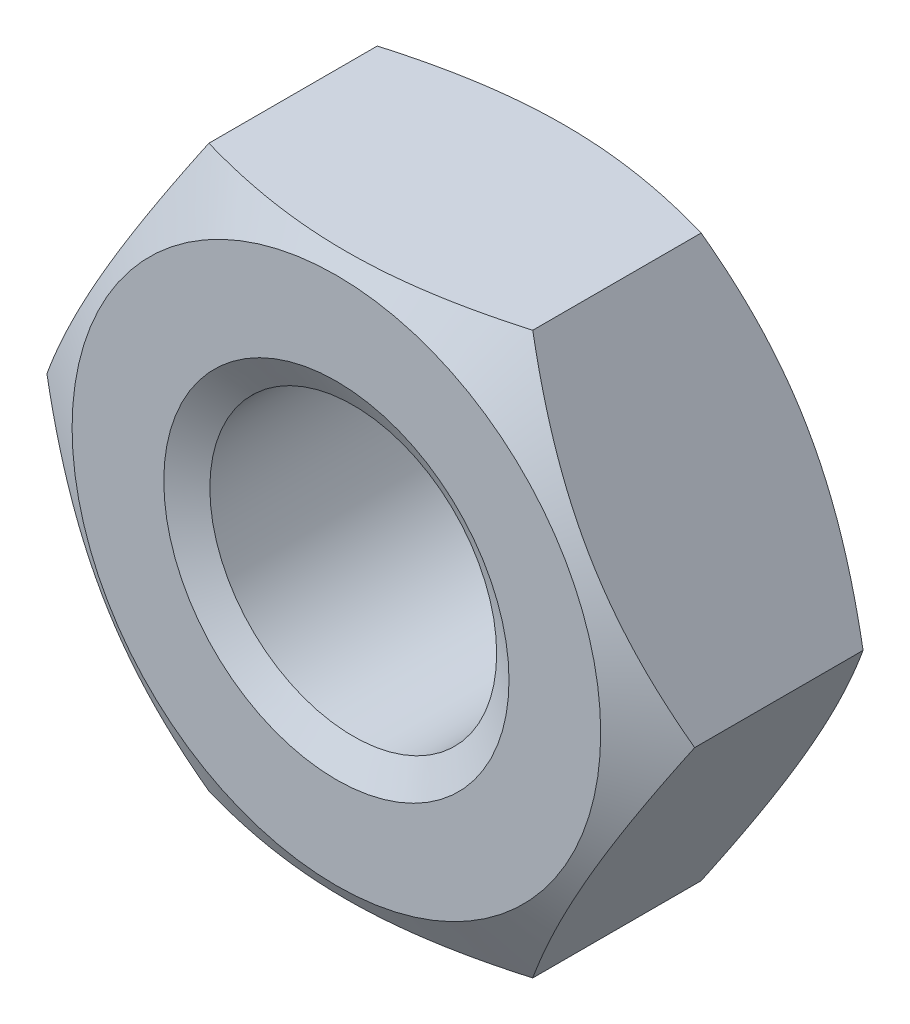
ISO-10303-21;
HEADER;
FILE_DESCRIPTION(('STEP AP214'),'2;1');
FILE_NAME('part.step','',(''),(''),'','','');
FILE_SCHEMA(('AUTOMOTIVE_DESIGN { 1 0 10303 214 1 1 1 1 }'));
ENDSEC;
DATA;
#1=APPLICATION_CONTEXT('core data for automotive mechanical design processes');
#2=APPLICATION_PROTOCOL_DEFINITION('international standard','automotive_design',2000,#1);
#3=PRODUCT_CONTEXT('',#1,'mechanical');
#4=PRODUCT('Part','Part','',(#3));
#5=PRODUCT_RELATED_PRODUCT_CATEGORY('part','',(#4));
#6=PRODUCT_DEFINITION_FORMATION('','',#4);
#7=PRODUCT_DEFINITION_CONTEXT('part definition',#1,'design');
#8=PRODUCT_DEFINITION('design','',#6,#7);
#9=PRODUCT_DEFINITION_SHAPE('','',#8);
#10=(LENGTH_UNIT() NAMED_UNIT(*) SI_UNIT(.MILLI.,.METRE.));
#11=(NAMED_UNIT(*) PLANE_ANGLE_UNIT() SI_UNIT($,.RADIAN.));
#12=(NAMED_UNIT(*) SI_UNIT($,.STERADIAN.) SOLID_ANGLE_UNIT());
#13=UNCERTAINTY_MEASURE_WITH_UNIT(LENGTH_MEASURE(1.E-05),#10,'distance_accuracy_value','');
#14=(GEOMETRIC_REPRESENTATION_CONTEXT(3) GLOBAL_UNCERTAINTY_ASSIGNED_CONTEXT((#13)) GLOBAL_UNIT_ASSIGNED_CONTEXT((#10,
#11,#12)) REPRESENTATION_CONTEXT('',''));
#15=CARTESIAN_POINT('',(0.,0.,0.));
#16=DIRECTION('',(0.,0.,1.));
#17=DIRECTION('',(1.,0.,0.));
#18=AXIS2_PLACEMENT_3D('',#15,#16,#17);
#19=CARTESIAN_POINT('',(0.,-13.,0.));
#20=DIRECTION('',(0.,0.,-1.));
#21=DIRECTION('',(-1.,0.,0.));
#22=AXIS2_PLACEMENT_3D('',#19,#20,#21);
#23=PLANE('',#22);
#24=CARTESIAN_POINT('',(0.,0.,0.));
#25=DIRECTION('',(0.,0.,-1.));
#26=DIRECTION('',(-1.,0.,0.));
#27=AXIS2_PLACEMENT_3D('',#24,#25,#26);
#28=CIRCLE('',#27,6.12499999994043);
#29=CARTESIAN_POINT('',(-6.12499999994043,0.,0.));
#30=VERTEX_POINT('',#29);
#31=EDGE_CURVE('E105',#30,#30,#28,.T.);
#32=ORIENTED_EDGE('',*,*,#31,.F.);
#33=EDGE_LOOP('',(#32));
#34=FACE_BOUND('',#33,.T.);
#35=CARTESIAN_POINT('',(0.,0.,0.));
#36=DIRECTION('',(0.,0.,1.));
#37=DIRECTION('',(1.,0.,0.));
#38=AXIS2_PLACEMENT_3D('',#35,#36,#37);
#39=CIRCLE('',#38,4.0000000000191);
#40=CARTESIAN_POINT('',(4.0000000000191,0.,0.));
#41=VERTEX_POINT('',#40);
#42=EDGE_CURVE('E20',#41,#41,#39,.F.);
#43=ORIENTED_EDGE('',*,*,#42,.T.);
#44=EDGE_LOOP('',(#43));
#45=FACE_BOUND('',#44,.T.);
#46=ADVANCED_FACE('F17',(#34,#45),#23,.F.);
#47=CARTESIAN_POINT('',(0.,0.,0.));
#48=DIRECTION('',(0.,0.,1.));
#49=DIRECTION('',(1.,0.,0.));
#50=AXIS2_PLACEMENT_3D('',#47,#48,#49);
#51=CONICAL_SURFACE('',#50,4.0000000000191,1.04719755120605);
#52=ORIENTED_EDGE('',*,*,#42,.F.);
#53=EDGE_LOOP('',(#52));
#54=FACE_BOUND('',#53,.T.);
#55=CARTESIAN_POINT('',(0.,0.,-0.39057745710678));
#56=DIRECTION('',(0.,0.,1.));
#57=DIRECTION('',(1.,0.,0.));
#58=AXIS2_PLACEMENT_3D('',#55,#56,#57);
#59=CIRCLE('',#58,3.3235);
#60=CARTESIAN_POINT('',(3.3235,0.,-0.39057745710678));
#61=VERTEX_POINT('',#60);
#62=EDGE_CURVE('E80',#61,#61,#59,.F.);
#63=ORIENTED_EDGE('',*,*,#62,.T.);
#64=EDGE_LOOP('',(#63));
#65=FACE_BOUND('',#64,.T.);
#66=ADVANCED_FACE('F152',(#54,#65),#51,.F.);
#67=CARTESIAN_POINT('',(0.,0.,-0.801845312196292));
#68=DIRECTION('',(0.,0.,-1.));
#69=DIRECTION('',(-1.,0.,0.));
#70=AXIS2_PLACEMENT_3D('',#67,#68,#69);
#71=CONICAL_SURFACE('',#70,7.5138368204648,1.04719755119331);
#72=CARTESIAN_POINT('',(7.50555349945997,-1.26746405809184E-11,-0.797062934582183));
#73=CARTESIAN_POINT('',(7.42306413225106,-0.142875775100371,-0.749446864134252));
#74=CARTESIAN_POINT('',(7.34026720584725,-0.286284258341302,-0.703991966642178));
#75=CARTESIAN_POINT('',(7.17400096467622,-0.574265835632288,-0.617999720662978));
#76=CARTESIAN_POINT('',(7.09053137628506,-0.718839403612883,-0.57746449352778));
#77=CARTESIAN_POINT('',(6.83878625276132,-1.15487474811409,-0.464034036214897));
#78=CARTESIAN_POINT('',(6.66951702603889,-1.44805764895502,-0.39951709945342));
#79=CARTESIAN_POINT('',(6.41620872846171,-1.88680049033741,-0.323865199560767));
#80=CARTESIAN_POINT('',(6.33292644226829,-2.03104964139492,-0.302314522006785));
#81=CARTESIAN_POINT('',(6.16598561363625,-2.32019963844327,-0.266178050220192));
#82=CARTESIAN_POINT('',(6.08232710510015,-2.46510042571322,-0.251591640626662));
#83=CARTESIAN_POINT('',(5.91486483881255,-2.75515357927398,-0.229755442526423));
#84=CARTESIAN_POINT('',(5.83106135446542,-2.90030547201451,-0.222497328854949));
#85=CARTESIAN_POINT('',(5.663381658914,-3.19073522410725,-0.215465561854509));
#86=CARTESIAN_POINT('',(5.57950545003741,-3.33601307942777,-0.215691677222158));
#87=CARTESIAN_POINT('',(5.34972638911367,-3.73400208746314,-0.226597904744973));
#88=CARTESIAN_POINT('',(5.20389879784426,-3.98658288468715,-0.244897374835346));
#89=CARTESIAN_POINT('',(4.913212163536,-4.49006690439025,-0.302918893745997));
#90=CARTESIAN_POINT('',(4.7683541423755,-4.74096835692412,-0.34266076347519));
#91=CARTESIAN_POINT('',(4.47708276744821,-5.24546517708864,-0.442001445728198));
#92=CARTESIAN_POINT('',(4.33070615631917,-5.49899690460388,-0.502021047428562));
#93=CARTESIAN_POINT('',(4.04013550251964,-6.00228004017317,-0.638240383200471));
#94=CARTESIAN_POINT('',(3.89593774018915,-6.25203789086733,-0.714408131324337));
#95=CARTESIAN_POINT('',(3.75277674973737,-6.49999999999169,-0.797062934584546));
#96=B_SPLINE_CURVE_WITH_KNOTS('',3,(#72,#73,#74,#75,#76,#77,#78,#79,#80,#81,#82,#83,#84,#85,#86,
#87,#88,#89,#90,#91,#92,#93,#94,#95),.UNSPECIFIED.,.F.,.F.,(4,2,2,2,2,2,2,2,2,2,2,4),(0.,
0.515097151807919,1.03041562924708,2.06319349702549,2.56693469263122,3.07063136955379,
3.57375518587219,4.0768634529426,4.95263085757274,5.82920919384532,6.72522583709603,
7.61948397792585),.UNSPECIFIED.);
#97=CARTESIAN_POINT('',(7.50555349943455,-6.01295083421546E-12,-0.797062934546425));
#98=VERTEX_POINT('',#97);
#99=CARTESIAN_POINT('',(3.75277674973527,-6.49999999999533,-0.797062934585759));
#100=VERTEX_POINT('',#99);
#101=EDGE_CURVE('E71',#98,#100,#96,.T.);
#102=ORIENTED_EDGE('',*,*,#101,.F.);
#103=CARTESIAN_POINT('',(3.75277674974378,6.49999999999553,-0.797062934579687));
#104=CARTESIAN_POINT('',(3.83526611694781,6.35712422490451,-0.74944686413392));
#105=CARTESIAN_POINT('',(3.9180630433495,6.21371574166224,-0.703991966642765));
#106=CARTESIAN_POINT('',(4.08432928451886,5.9257341643704,-0.617999720664248));
#107=CARTESIAN_POINT('',(4.16779887291045,5.78116059639029,-0.577464493528816));
#108=CARTESIAN_POINT('',(4.4195439964348,5.34512525188997,-0.464034036215522));
#109=CARTESIAN_POINT('',(4.58881322315667,5.05194235104894,-0.399517099454174));
#110=CARTESIAN_POINT('',(4.84212152073355,4.61319950966673,-0.323865199561441));
#111=CARTESIAN_POINT('',(4.92540380692696,4.46895035860932,-0.302314522007389));
#112=CARTESIAN_POINT('',(5.09234463555894,4.17980036156114,-0.266178050220664));
#113=CARTESIAN_POINT('',(5.17600314409498,4.03489957429126,-0.251591640627072));
#114=CARTESIAN_POINT('',(5.34346541038249,3.74484642073065,-0.229755442526694));
#115=CARTESIAN_POINT('',(5.42726889472957,3.5996945279902,-0.222497328855143));
#116=CARTESIAN_POINT('',(5.5949485902809,3.30926477589762,-0.215465561854542));
#117=CARTESIAN_POINT('',(5.67882479915745,3.16398692057717,-0.215691677222107));
#118=CARTESIAN_POINT('',(5.90860386008122,2.76599791254175,-0.226597904744688));
#119=CARTESIAN_POINT('',(6.05443145135071,2.5134171153176,-0.244897374834928));
#120=CARTESIAN_POINT('',(6.34511808565913,2.00993309561422,-0.302918893745348));
#121=CARTESIAN_POINT('',(6.48997610681972,1.7590316430802,-0.342660763474445));
#122=CARTESIAN_POINT('',(6.78124748174717,1.2545348229154,-0.442001445727291));
#123=CARTESIAN_POINT('',(6.92762409287628,1.00100309540004,-0.502021047427587));
#124=CARTESIAN_POINT('',(7.21819474667595,0.497719959830505,-0.638240383199387));
#125=CARTESIAN_POINT('',(7.3623925090065,0.247962109136237,-0.714408131323212));
#126=CARTESIAN_POINT('',(7.50555349945834,1.17642045864442E-11,-0.797062934583393));
#127=B_SPLINE_CURVE_WITH_KNOTS('',3,(#103,#104,#105,#106,#107,#108,#109,#110,#111,#112,#113,
#114,#115,#116,#117,#118,#119,#120,#121,#122,#123,#124,#125,#126),.UNSPECIFIED.,.F.,.F.,(4,2,2,
2,2,2,2,2,2,2,2,4),(0.,0.515097151807478,1.03041562924625,2.063193497024,2.56693469262949,
3.07063136955181,3.57375518586995,4.07686345294009,4.95263085757068,5.82920919384372,
6.72522583709482,7.61948397792498),.UNSPECIFIED.);
#128=CARTESIAN_POINT('',(3.75277674972718,6.5,-0.797062934585759));
#129=VERTEX_POINT('',#128);
#130=EDGE_CURVE('E61',#129,#98,#127,.T.);
#131=ORIENTED_EDGE('',*,*,#130,.F.);
#132=CARTESIAN_POINT('',(-3.75277674972309,6.50000000000748,-0.797062934579684));
#133=CARTESIAN_POINT('',(-3.58779801530686,6.50000000000275,-0.749446864133918));
#134=CARTESIAN_POINT('',(-3.42220416250001,6.50000000000075,-0.703991966642763));
#135=CARTESIAN_POINT('',(-3.08967168015869,6.49999999999925,-0.617999720664246));
#136=CARTESIAN_POINT('',(-2.92273250337635,6.49999999999974,-0.577464493528813));
#137=CARTESIAN_POINT('',(-2.41924225632901,6.50000000000052,-0.46403403621552));
#138=CARTESIAN_POINT('',(-2.08070380288452,6.50000000000009,-0.399517099454172));
#139=CARTESIAN_POINT('',(-1.57408720773052,6.49999999999995,-0.32386519956144));
#140=CARTESIAN_POINT('',(-1.40752263534376,6.49999999999999,-0.302314522007387));
#141=CARTESIAN_POINT('',(-1.07364097807985,6.50000000000001,-0.266178050220662));
#142=CARTESIAN_POINT('',(-0.906323961007753,6.5,-0.25159164062707));
#143=CARTESIAN_POINT('',(-0.57139942843272,6.5,-0.229755442526693));
#144=CARTESIAN_POINT('',(-0.403792459738558,6.5,-0.222497328855141));
#145=CARTESIAN_POINT('',(-0.0684330686359017,6.5,-0.21546556185454));
#146=CARTESIAN_POINT('',(0.0993193491171958,6.5,-0.215691677222106));
#147=CARTESIAN_POINT('',(0.558877470965063,6.5,-0.226597904744695));
#148=CARTESIAN_POINT('',(0.850532653504385,6.5,-0.244897374834969));
#149=CARTESIAN_POINT('',(1.4319059221219,6.5,-0.302918893745506));
#150=CARTESIAN_POINT('',(1.7216219644434,6.5,-0.342660763474685));
#151=CARTESIAN_POINT('',(2.30416471429897,6.5,-0.442001445727735));
#152=CARTESIAN_POINT('',(2.59691793655753,6.5,-0.502021047428155));
#153=CARTESIAN_POINT('',(3.17805924415753,6.5,-0.63824038320023));
#154=CARTESIAN_POINT('',(3.46645476881897,6.5,-0.714408131324206));
#155=CARTESIAN_POINT('',(3.75277674972298,6.5,-0.797062934584545));
#156=B_SPLINE_CURVE_WITH_KNOTS('',3,(#132,#133,#134,#135,#136,#137,#138,#139,#140,#141,#142,
#143,#144,#145,#146,#147,#148,#149,#150,#151,#152,#153,#154,#155),.UNSPECIFIED.,.F.,.F.,(4,2,2,
2,2,2,2,2,2,2,2,4),(0.,0.51509715180748,1.03041562924625,2.06319349702401,2.56693469262949,
3.07063136955181,3.57375518586995,4.07686345294009,4.95263085757168,5.82920919384574,
6.72522583709791,7.61948397792913),.UNSPECIFIED.);
#157=CARTESIAN_POINT('',(-3.75277674973526,6.49999999999533,-0.797062934585758));
#158=VERTEX_POINT('',#157);
#159=EDGE_CURVE('E91',#158,#129,#156,.T.);
#160=ORIENTED_EDGE('',*,*,#159,.F.);
#161=CARTESIAN_POINT('',(-7.50555349945997,1.26724419200023E-11,-0.79706293458218));
#162=CARTESIAN_POINT('',(-7.42306413225105,0.142875775100368,-0.74944686413425));
#163=CARTESIAN_POINT('',(-7.34026720584725,0.286284258341299,-0.703991966642177));
#164=CARTESIAN_POINT('',(-7.17400096467621,0.574265835632285,-0.617999720662976));
#165=CARTESIAN_POINT('',(-7.09053137628506,0.71883940361288,-0.577464493527778));
#166=CARTESIAN_POINT('',(-6.83878625276132,1.15487474811409,-0.464034036214895));
#167=CARTESIAN_POINT('',(-6.66951702603889,1.44805764895501,-0.399517099453419));
#168=CARTESIAN_POINT('',(-6.41620872846171,1.8868004903374,-0.323865199560765));
#169=CARTESIAN_POINT('',(-6.33292644226829,2.03104964139492,-0.302314522006782));
#170=CARTESIAN_POINT('',(-6.16598561363625,2.32019963844327,-0.266178050220189));
#171=CARTESIAN_POINT('',(-6.08232710510015,2.46510042571321,-0.25159164062666));
#172=CARTESIAN_POINT('',(-5.91486483881255,2.75515357927397,-0.229755442526421));
#173=CARTESIAN_POINT('',(-5.83106135446542,2.9003054720145,-0.222497328854946));
#174=CARTESIAN_POINT('',(-5.663381658914,3.19073522410724,-0.215465561854506));
#175=CARTESIAN_POINT('',(-5.57950545003741,3.33601307942776,-0.215691677222155));
#176=CARTESIAN_POINT('',(-5.34972638911367,3.73400208746313,-0.22659790474497));
#177=CARTESIAN_POINT('',(-5.20389879784426,3.98658288468715,-0.244897374835343));
#178=CARTESIAN_POINT('',(-4.913212163536,4.49006690439024,-0.302918893745994));
#179=CARTESIAN_POINT('',(-4.7683541423755,4.74096835692412,-0.342660763475187));
#180=CARTESIAN_POINT('',(-4.4770827674482,5.24546517708864,-0.442001445728195));
#181=CARTESIAN_POINT('',(-4.33070615631917,5.49899690460388,-0.50202104742856));
#182=CARTESIAN_POINT('',(-4.04013550251964,6.00228004017318,-0.63824038320047));
#183=CARTESIAN_POINT('',(-3.89593774018914,6.25203789086733,-0.714408131324337));
#184=CARTESIAN_POINT('',(-3.75277674973736,6.4999999999917,-0.797062934584547));
#185=B_SPLINE_CURVE_WITH_KNOTS('',3,(#161,#162,#163,#164,#165,#166,#167,#168,#169,#170,#171,
#172,#173,#174,#175,#176,#177,#178,#179,#180,#181,#182,#183,#184),.UNSPECIFIED.,.F.,.F.,(4,2,2,
2,2,2,2,2,2,2,2,4),(0.,0.515097151807918,1.03041562924708,2.06319349702549,2.56693469263122,
3.07063136955378,3.57375518587219,4.07686345294259,4.95263085757274,5.82920919384532,
6.72522583709604,7.61948397792586),.UNSPECIFIED.);
#186=CARTESIAN_POINT('',(-7.50555349943932,0.,-0.797062934576849));
#187=VERTEX_POINT('',#186);
#188=EDGE_CURVE('E95',#187,#158,#185,.T.);
#189=ORIENTED_EDGE('',*,*,#188,.F.);
#190=CARTESIAN_POINT('',(-3.75277674974378,-6.49999999999553,-0.797062934579687));
#191=CARTESIAN_POINT('',(-3.83526611694781,-6.35712422490451,-0.74944686413392));
#192=CARTESIAN_POINT('',(-3.9180630433495,-6.21371574166224,-0.703991966642765));
#193=CARTESIAN_POINT('',(-4.08432928451886,-5.9257341643704,-0.617999720664248));
#194=CARTESIAN_POINT('',(-4.16779887291045,-5.78116059639028,-0.577464493528815));
#195=CARTESIAN_POINT('',(-4.4195439964348,-5.34512525188997,-0.464034036215522));
#196=CARTESIAN_POINT('',(-4.58881322315667,-5.05194235104894,-0.399517099454173));
#197=CARTESIAN_POINT('',(-4.84212152073355,-4.61319950966673,-0.323865199561441));
#198=CARTESIAN_POINT('',(-4.92540380692696,-4.46895035860932,-0.302314522007389));
#199=CARTESIAN_POINT('',(-5.09234463555893,-4.17980036156114,-0.266178050220664));
#200=CARTESIAN_POINT('',(-5.17600314409498,-4.03489957429126,-0.251591640627072));
#201=CARTESIAN_POINT('',(-5.34346541038249,-3.74484642073065,-0.229755442526694));
#202=CARTESIAN_POINT('',(-5.42726889472957,-3.5996945279902,-0.222497328855143));
#203=CARTESIAN_POINT('',(-5.5949485902809,-3.30926477589762,-0.215465561854542));
#204=CARTESIAN_POINT('',(-5.67882479915745,-3.16398692057717,-0.215691677222107));
#205=CARTESIAN_POINT('',(-5.90860386008122,-2.76599791254175,-0.226597904744688));
#206=CARTESIAN_POINT('',(-6.05443145135071,-2.5134171153176,-0.244897374834928));
#207=CARTESIAN_POINT('',(-6.34511808565913,-2.00993309561422,-0.302918893745348));
#208=CARTESIAN_POINT('',(-6.48997610681972,-1.7590316430802,-0.342660763474445));
#209=CARTESIAN_POINT('',(-6.78124748174717,-1.25453482291541,-0.44200144572729));
#210=CARTESIAN_POINT('',(-6.92762409287628,-1.00100309540004,-0.502021047427587));
#211=CARTESIAN_POINT('',(-7.21819474667594,-0.497719959830508,-0.638240383199386));
#212=CARTESIAN_POINT('',(-7.3623925090065,-0.247962109136239,-0.714408131323212));
#213=CARTESIAN_POINT('',(-7.50555349945834,-1.17669440239003E-11,-0.797062934583392));
#214=B_SPLINE_CURVE_WITH_KNOTS('',3,(#190,#191,#192,#193,#194,#195,#196,#197,#198,#199,#200,
#201,#202,#203,#204,#205,#206,#207,#208,#209,#210,#211,#212,#213),.UNSPECIFIED.,.F.,.F.,(4,2,2,
2,2,2,2,2,2,2,2,4),(0.,0.515097151807478,1.03041562924625,2.063193497024,2.56693469262948,
3.07063136955181,3.57375518586995,4.07686345294009,4.95263085757067,5.82920919384372,
6.72522583709482,7.61948397792498),.UNSPECIFIED.);
#215=CARTESIAN_POINT('',(-3.75277674972718,-6.5,-0.797062934585759));
#216=VERTEX_POINT('',#215);
#217=EDGE_CURVE('E99',#216,#187,#214,.T.);
#218=ORIENTED_EDGE('',*,*,#217,.F.);
#219=CARTESIAN_POINT('',(3.7527767497231,-6.50000000000747,-0.797062934579686));
#220=CARTESIAN_POINT('',(3.58779801530687,-6.50000000000275,-0.74944686413392));
#221=CARTESIAN_POINT('',(3.42220416250002,-6.50000000000075,-0.703991966642764));
#222=CARTESIAN_POINT('',(3.0896716801587,-6.49999999999925,-0.617999720664247));
#223=CARTESIAN_POINT('',(2.92273250337636,-6.49999999999974,-0.577464493528814));
#224=CARTESIAN_POINT('',(2.41924225632902,-6.50000000000052,-0.46403403621552));
#225=CARTESIAN_POINT('',(2.08070380288453,-6.50000000000009,-0.399517099454173));
#226=CARTESIAN_POINT('',(1.57408720773053,-6.49999999999995,-0.32386519956144));
#227=CARTESIAN_POINT('',(1.40752263534377,-6.49999999999999,-0.302314522007387));
#228=CARTESIAN_POINT('',(1.07364097807986,-6.50000000000001,-0.266178050220662));
#229=CARTESIAN_POINT('',(0.90632396100776,-6.5,-0.25159164062707));
#230=CARTESIAN_POINT('',(0.571399428432728,-6.5,-0.229755442526693));
#231=CARTESIAN_POINT('',(0.403792459738565,-6.5,-0.222497328855142));
#232=CARTESIAN_POINT('',(0.0684330686359089,-6.5,-0.21546556185454));
#233=CARTESIAN_POINT('',(-0.0993193491171888,-6.5,-0.215691677222105));
#234=CARTESIAN_POINT('',(-0.558877470965056,-6.5,-0.226597904744694));
#235=CARTESIAN_POINT('',(-0.850532653504379,-6.5,-0.244897374834968));
#236=CARTESIAN_POINT('',(-1.43190592212189,-6.5,-0.302918893745506));
#237=CARTESIAN_POINT('',(-1.72162196444339,-6.5,-0.342660763474684));
#238=CARTESIAN_POINT('',(-2.30416471429897,-6.5,-0.442001445727734));
#239=CARTESIAN_POINT('',(-2.59691793655752,-6.5,-0.502021047428154));
#240=CARTESIAN_POINT('',(-3.17805924415753,-6.5,-0.638240383200229));
#241=CARTESIAN_POINT('',(-3.46645476881897,-6.5,-0.714408131324205));
#242=CARTESIAN_POINT('',(-3.75277674972298,-6.5,-0.797062934584545));
#243=B_SPLINE_CURVE_WITH_KNOTS('',3,(#219,#220,#221,#222,#223,#224,#225,#226,#227,#228,#229,
#230,#231,#232,#233,#234,#235,#236,#237,#238,#239,#240,#241,#242),.UNSPECIFIED.,.F.,.F.,(4,2,2,
2,2,2,2,2,2,2,2,4),(0.,0.515097151807481,1.03041562924625,2.06319349702401,2.56693469262949,
3.07063136955181,3.57375518586995,4.07686345294009,4.95263085757169,5.82920919384575,
6.72522583709792,7.61948397792914),.UNSPECIFIED.);
#244=EDGE_CURVE('E75',#100,#216,#243,.T.);
#245=ORIENTED_EDGE('',*,*,#244,.F.);
#246=EDGE_LOOP('',(#102,#131,#160,#189,#218,#245));
#247=FACE_BOUND('',#246,.T.);
#248=ORIENTED_EDGE('',*,*,#31,.T.);
#249=EDGE_LOOP('',(#248));
#250=FACE_BOUND('',#249,.T.);
#251=ADVANCED_FACE('F72',(#247,#250),#71,.T.);
#252=CARTESIAN_POINT('',(0.,0.,-6.8));
#253=DIRECTION('',(0.,0.,1.));
#254=DIRECTION('',(1.,0.,0.));
#255=AXIS2_PLACEMENT_3D('',#252,#253,#254);
#256=CYLINDRICAL_SURFACE('',#255,3.3235);
#257=CARTESIAN_POINT('',(0.,0.,-5.09999999997035));
#258=DIRECTION('',(0.,0.,-1.));
#259=DIRECTION('',(-1.,0.,0.));
#260=AXIS2_PLACEMENT_3D('',#257,#258,#259);
#261=CIRCLE('',#260,3.3235000000218);
#262=CARTESIAN_POINT('',(-3.3235000000218,0.,-5.09999999997035));
#263=VERTEX_POINT('',#262);
#264=EDGE_CURVE('E85',#263,#263,#261,.T.);
#265=ORIENTED_EDGE('',*,*,#264,.T.);
#266=EDGE_LOOP('',(#265));
#267=FACE_BOUND('',#266,.T.);
#268=ORIENTED_EDGE('',*,*,#62,.F.);
#269=EDGE_LOOP('',(#268));
#270=FACE_BOUND('',#269,.T.);
#271=ADVANCED_FACE('F151',(#267,#270),#256,.F.);
#272=CARTESIAN_POINT('',(3.75277674973258,-6.5,-6.8));
#273=DIRECTION('',(0.866025403784439,-0.5,0.));
#274=DIRECTION('',(0.5,0.866025403784439,0.));
#275=AXIS2_PLACEMENT_3D('',#272,#273,#274);
#276=PLANE('',#275);
#277=ORIENTED_EDGE('',*,*,#101,.T.);
#278=DIRECTION('',(0.,0.,1.));
#279=VECTOR('',#278,1.);
#280=CARTESIAN_POINT('',(3.75277674973258,-6.5,-6.8));
#281=LINE('',#280,#279);
#282=CARTESIAN_POINT('',(3.75277677137748,-6.49999996250993,-4.70000001243648));
#283=VERTEX_POINT('',#282);
#284=EDGE_CURVE('E79',#283,#100,#281,.T.);
#285=ORIENTED_EDGE('',*,*,#284,.F.);
#286=CARTESIAN_POINT('',(7.50555349943961,-4.59927503235988E-11,-4.69999999990956));
#287=CARTESIAN_POINT('',(7.42303699090516,-0.142922785289727,-4.74780718963419));
#288=CARTESIAN_POINT('',(7.34021064037411,-0.286382232614545,-4.7934451338097));
#289=CARTESIAN_POINT('',(7.17388030748702,-0.574474820014469,-4.87978381108413));
#290=CARTESIAN_POINT('',(7.0903760468018,-0.719108442169872,-4.92048239416971));
#291=CARTESIAN_POINT('',(6.83851575107887,-1.1553432707715,-5.03436935455443));
#292=CARTESIAN_POINT('',(6.66915808624861,-1.44867935090862,-5.09914319894474));
#293=CARTESIAN_POINT('',(6.41572193059373,-1.88764364897778,-5.1750751216362));
#294=CARTESIAN_POINT('',(6.33240638004381,-2.03195041559082,-5.19670009757581));
#295=CARTESIAN_POINT('',(6.16539624694976,-2.32122045148856,-5.23295346143799));
#296=CARTESIAN_POINT('',(6.08170169885143,-2.46618366111138,-5.24758247280886));
#297=CARTESIAN_POINT('',(5.91416672131715,-2.75636275424566,-5.26946983898017));
#298=CARTESIAN_POINT('',(5.8303265696832,-2.90157815658994,-5.27673663664082));
#299=CARTESIAN_POINT('',(5.66257345475982,-3.19213507476518,-5.28375134433767));
#300=CARTESIAN_POINT('',(5.57866049382923,-3.3374765865105,-5.28349948948667));
#301=CARTESIAN_POINT('',(5.34891260639935,-3.73541160047067,-5.27248255514731));
#302=CARTESIAN_POINT('',(5.20315399770455,-3.98787291637062,-5.25408410996374));
#303=CARTESIAN_POINT('',(4.91261238717601,-4.49110574751894,-5.19581136800484));
#304=CARTESIAN_POINT('',(4.76783042287445,-4.74187546570887,-5.15591704323436));
#305=CARTESIAN_POINT('',(4.47670158312332,-5.24612540770639,-5.0562190888417));
#306=CARTESIAN_POINT('',(4.330391935388,-5.49954115122147,-4.99599085196764));
#307=CARTESIAN_POINT('',(4.03996879204939,-6.0025687911778,-4.85931971681482));
#308=CARTESIAN_POINT('',(3.89585152461738,-6.25218722061804,-4.78290912956535));
#309=CARTESIAN_POINT('',(3.75277679302145,-6.49999992502148,-4.70000002497868));
#310=B_SPLINE_CURVE_WITH_KNOTS('',3,(#286,#287,#288,#289,#290,#291,#292,#293,#294,#295,#296,
#297,#298,#299,#300,#301,#302,#303,#304,#305,#306,#307,#308,#309),.UNSPECIFIED.,.F.,.F.,(4,2,2,
2,2,2,2,2,2,2,2,4),(0.,0.515412518945595,1.03104858893057,2.06448237103259,2.56844910772266,
3.07237092483326,3.57571419669567,4.07904172872666,4.9544095024563,5.83059428178326,
6.7263406391918,7.62031505857119),.UNSPECIFIED.);
#311=CARTESIAN_POINT('',(7.5055534994096,0.,-4.69999999996168));
#312=VERTEX_POINT('',#311);
#313=EDGE_CURVE('E84',#312,#283,#310,.T.);
#314=ORIENTED_EDGE('',*,*,#313,.F.);
#315=DIRECTION('',(0.,0.,1.));
#316=VECTOR('',#315,1.);
#317=CARTESIAN_POINT('',(7.50555349946514,0.,-6.8));
#318=LINE('',#317,#316);
#319=EDGE_CURVE('E35',#98,#312,#318,.F.);
#320=ORIENTED_EDGE('',*,*,#319,.F.);
#321=EDGE_LOOP('',(#277,#285,#314,#320));
#322=FACE_BOUND('',#321,.T.);
#323=ADVANCED_FACE('F83',(#322),#276,.T.);
#324=CARTESIAN_POINT('',(-3.75277674973256,-6.5,-6.8));
#325=DIRECTION('',(0.,-1.,0.));
#326=DIRECTION('',(1.,0.,0.));
#327=AXIS2_PLACEMENT_3D('',#324,#325,#326);
#328=PLANE('',#327);
#329=ORIENTED_EDGE('',*,*,#244,.T.);
#330=DIRECTION('',(0.,0.,1.));
#331=VECTOR('',#330,1.);
#332=CARTESIAN_POINT('',(-3.75277674973257,-6.5,-6.8));
#333=LINE('',#332,#331);
#334=CARTESIAN_POINT('',(-3.75277670644439,-6.5,-4.70000001243601));
#335=VERTEX_POINT('',#334);
#336=EDGE_CURVE('E100',#335,#216,#333,.T.);
#337=ORIENTED_EDGE('',*,*,#336,.F.);
#338=CARTESIAN_POINT('',(3.75277677636153,-6.49999996253879,-4.69999996768154));
#339=CARTESIAN_POINT('',(3.58774376180418,-6.49999998621388,-4.74780717247496));
#340=CARTESIAN_POINT('',(3.42209106096878,-6.49999999622857,-4.79344512342462));
#341=CARTESIAN_POINT('',(3.0894303936541,-6.50000000377306,-4.87978380660095));
#342=CARTESIAN_POINT('',(2.92242187051639,-6.50000000129746,-4.92048238881426));
#343=CARTESIAN_POINT('',(2.41870127454236,-6.49999999739963,-5.03436934857476));
#344=CARTESIAN_POINT('',(2.07998594267824,-6.49999999953161,-5.09914319528522));
#345=CARTESIAN_POINT('',(1.57311362780811,-6.50000000022842,-5.1750751196359));
#346=CARTESIAN_POINT('',(1.40648252559796,-6.5000000000612,-5.19670009582551));
#347=CARTESIAN_POINT('',(1.07246225723202,-6.4999999999388,-5.23295346023176));
#348=CARTESIAN_POINT('',(0.905073159967937,-6.49999999998359,-5.24758247189773));
#349=CARTESIAN_POINT('',(0.570003202688611,-6.50000000001639,-5.26946983853795));
#350=CARTESIAN_POINT('',(0.402322898277242,-6.50000000000447,-5.27673663637015));
#351=CARTESIAN_POINT('',(0.0668166661282161,-6.49999999999553,-5.28375134431755));
#352=CARTESIAN_POINT('',(-0.101009256891759,-6.49999999999851,-5.28349948954504));
#353=CARTESIAN_POINT('',(-0.56050503309441,-6.5000000000026,-5.27248255531847));
#354=CARTESIAN_POINT('',(-0.852022250671479,-6.5000000000007,-5.25408411020438));
#355=CARTESIAN_POINT('',(-1.43310547204756,-6.4999999999993,-5.19581136835763));
#356=CARTESIAN_POINT('',(-1.72266940078265,-6.4999999999998,-5.15591704363408));
#357=CARTESIAN_POINT('',(-2.3049270808084,-6.50000000000021,-5.05621908926672));
#358=CARTESIAN_POINT('',(-2.59754637666756,-6.5000000000001,-4.99599085235329));
#359=CARTESIAN_POINT('',(-3.17839266419266,-6.4999999999999,-4.85931971705513));
#360=CARTESIAN_POINT('',(-3.46662719951503,-6.49999999999979,-4.78290912969524));
#361=CARTESIAN_POINT('',(-3.75277666315791,-6.5,-4.70000002497779));
#362=B_SPLINE_CURVE_WITH_KNOTS('',3,(#338,#339,#340,#341,#342,#343,#344,#345,#346,#347,#348,
#349,#350,#351,#352,#353,#354,#355,#356,#357,#358,#359,#360,#361),.UNSPECIFIED.,.F.,.F.,(4,2,2,
2,2,2,2,2,2,2,2,4),(0.,0.515412523676989,1.03104859805641,2.0644823882594,2.56844912830344,
3.0723709486937,3.5757142239973,4.07904175950238,4.95440953377745,5.83059431347618,
6.72634067204767,7.62031509283759),.UNSPECIFIED.);
#363=EDGE_CURVE('E184',#283,#335,#362,.T.);
#364=ORIENTED_EDGE('',*,*,#363,.F.);
#365=ORIENTED_EDGE('',*,*,#284,.T.);
#366=EDGE_LOOP('',(#329,#337,#364,#365));
#367=FACE_BOUND('',#366,.T.);
#368=ADVANCED_FACE('F176',(#367),#328,.T.);
#369=CARTESIAN_POINT('',(-7.50555349946514,0.,-6.8));
#370=DIRECTION('',(-0.866025403784439,-0.5,0.));
#371=DIRECTION('',(0.5,-0.866025403784439,0.));
#372=AXIS2_PLACEMENT_3D('',#369,#370,#371);
#373=PLANE('',#372);
#374=ORIENTED_EDGE('',*,*,#217,.T.);
#375=DIRECTION('',(0.,0.,1.));
#376=VECTOR('',#375,1.);
#377=CARTESIAN_POINT('',(-7.50555349946514,0.,-6.8));
#378=LINE('',#377,#376);
#379=CARTESIAN_POINT('',(-7.50555349942641,0.,-4.69999999995707));
#380=VERTEX_POINT('',#379);
#381=EDGE_CURVE('E96',#380,#187,#378,.T.);
#382=ORIENTED_EDGE('',*,*,#381,.F.);
#383=CARTESIAN_POINT('',(-3.75277670397815,-6.5000000043286,-4.69999996768309));
#384=CARTESIAN_POINT('',(-3.83529323176657,-6.35707723308378,-4.74780717248016));
#385=CARTESIAN_POINT('',(-3.91811959086411,-6.21361779094972,-4.79344512343332));
#386=CARTESIAN_POINT('',(-4.08444993106929,-5.92552520596272,-4.87978380661597));
#387=CARTESIAN_POINT('',(-4.16795419050146,-5.78089158102671,-4.9204823888321));
#388=CARTESIAN_POINT('',(-4.41981448513655,-5.34465674651404,-5.03436934860022));
#389=CARTESIAN_POINT('',(-4.58917215293151,-5.05132066550562,-5.09914319531358));
#390=CARTESIAN_POINT('',(-4.84260831097949,-4.61235636468505,-5.1750751196594));
#391=CARTESIAN_POINT('',(-4.92592386193245,-4.4680495970395,-5.19670009584481));
#392=CARTESIAN_POINT('',(-5.0929339959947,-4.17877955922,-5.23295346024381));
#393=CARTESIAN_POINT('',(-5.17662854465812,-4.03381634870798,-5.24758247190674));
#394=CARTESIAN_POINT('',(-5.3441635233105,-3.7436372537027,-5.2694698385419));
#395=CARTESIAN_POINT('',(-5.42800367549758,-3.59842185037654,-5.27673663637216));
#396=CARTESIAN_POINT('',(-5.59575679154784,-3.30786493023159,-5.28375134431765));
#397=CARTESIAN_POINT('',(-5.67966975305219,-3.16252341749845,-5.28349948954516));
#398=CARTESIAN_POINT('',(-5.90941764480213,-2.76458839606389,-5.27248255514233));
#399=CARTESIAN_POINT('',(-6.05517625723745,-2.51212707368138,-5.25408410927836));
#400=CARTESIAN_POINT('',(-6.34571787515919,-2.00889422972486,-5.19581136490171));
#401=CARTESIAN_POINT('',(-6.4904998431135,-1.75812450520919,-5.15591703839568));
#402=CARTESIAN_POINT('',(-6.78162869038322,-1.2538745501899,-5.05621907958446));
#403=CARTESIAN_POINT('',(-6.92793834197926,-1.00045879998765,-4.99599083997729));
#404=CARTESIAN_POINT('',(-7.21836149294048,-0.497431146828147,-4.85931969870662));
#405=CARTESIAN_POINT('',(-7.36247876413436,-0.247812710871959,-4.78290910807156));
#406=CARTESIAN_POINT('',(-7.50555349943884,-4.55567710809223E-11,-4.69999999990898));
#407=B_SPLINE_CURVE_WITH_KNOTS('',3,(#383,#384,#385,#386,#387,#388,#389,#390,#391,#392,#393,
#394,#395,#396,#397,#398,#399,#400,#401,#402,#403,#404,#405,#406),.UNSPECIFIED.,.F.,.F.,(4,2,2,
2,2,2,2,2,2,2,2,4),(0.,0.51541252372083,1.03104859814418,2.06448238844628,2.56844912844525,
3.07237094879053,3.57571422404399,4.07904175950088,4.95440955569391,5.83059435739228,
6.72634073911342,7.62031518287544),.UNSPECIFIED.);
#408=EDGE_CURVE('E190',#335,#380,#407,.T.);
#409=ORIENTED_EDGE('',*,*,#408,.F.);
#410=ORIENTED_EDGE('',*,*,#336,.T.);
#411=EDGE_LOOP('',(#374,#382,#409,#410));
#412=FACE_BOUND('',#411,.T.);
#413=ADVANCED_FACE('F180',(#412),#373,.T.);
#414=CARTESIAN_POINT('',(-3.75277674973257,6.5,-6.8));
#415=DIRECTION('',(-0.866025403784439,0.5,0.));
#416=DIRECTION('',(-0.5,-0.866025403784439,0.));
#417=AXIS2_PLACEMENT_3D('',#414,#415,#416);
#418=PLANE('',#417);
#419=ORIENTED_EDGE('',*,*,#188,.T.);
#420=DIRECTION('',(0.,0.,1.));
#421=VECTOR('',#420,1.);
#422=CARTESIAN_POINT('',(-3.75277674973257,6.5,-6.8));
#423=LINE('',#422,#421);
#424=CARTESIAN_POINT('',(-3.75277677136604,6.49999996252973,-4.70000001242986));
#425=VERTEX_POINT('',#424);
#426=EDGE_CURVE('E92',#425,#158,#423,.T.);
#427=ORIENTED_EDGE('',*,*,#426,.F.);
#428=CARTESIAN_POINT('',(-7.50555349943961,4.5991713707232E-11,-4.69999999990956));
#429=CARTESIAN_POINT('',(-7.42303699090516,0.142922785289732,-4.74780718963419));
#430=CARTESIAN_POINT('',(-7.3402106403741,0.286382232614555,-4.79344513380971));
#431=CARTESIAN_POINT('',(-7.173880307487,0.574474820014493,-4.87978381108414));
#432=CARTESIAN_POINT('',(-7.09037604680178,0.719108442169902,-4.92048239416972));
#433=CARTESIAN_POINT('',(-6.83851575107883,1.15534327077155,-5.03436935455445));
#434=CARTESIAN_POINT('',(-6.66915808624857,1.44867935090868,-5.09914319894475));
#435=CARTESIAN_POINT('',(-6.41572193059368,1.88764364897785,-5.17507512163621));
#436=CARTESIAN_POINT('',(-6.33240638004376,2.03195041559089,-5.19670009757582));
#437=CARTESIAN_POINT('',(-6.16539624694972,2.32122045148861,-5.232953461438));
#438=CARTESIAN_POINT('',(-6.0817016988514,2.46618366111143,-5.24758247280887));
#439=CARTESIAN_POINT('',(-5.91416672131713,2.75636275424569,-5.26946983898017));
#440=CARTESIAN_POINT('',(-5.83032656968319,2.90157815658996,-5.27673663664082));
#441=CARTESIAN_POINT('',(-5.66257345475981,3.19213507476519,-5.28375134433767));
#442=CARTESIAN_POINT('',(-5.57866049382922,3.33747658651051,-5.28349948948667));
#443=CARTESIAN_POINT('',(-5.34891260639749,3.73541160047388,-5.27248255514722));
#444=CARTESIAN_POINT('',(-5.20315399770084,3.98787291637702,-5.25408410996328));
#445=CARTESIAN_POINT('',(-4.91261238716863,4.4911057475317,-5.19581136800309));
#446=CARTESIAN_POINT('',(-4.76783042286525,4.74187546572478,-5.15591704323171));
#447=CARTESIAN_POINT('',(-4.47670158311045,5.24612540772867,-5.05621908883679));
#448=CARTESIAN_POINT('',(-4.33039193537327,5.49954115124697,-4.99599085196137));
#449=CARTESIAN_POINT('',(-4.03996879203102,6.00256879120962,-4.85931971680552));
#450=CARTESIAN_POINT('',(-3.89585152459721,6.25218722065296,-4.78290912955439));
#451=CARTESIAN_POINT('',(-3.75277679299951,6.49999992505946,-4.70000002496597));
#452=B_SPLINE_CURVE_WITH_KNOTS('',3,(#428,#429,#430,#431,#432,#433,#434,#435,#436,#437,#438,
#439,#440,#441,#442,#443,#444,#445,#446,#447,#448,#449,#450,#451),.UNSPECIFIED.,.F.,.F.,(4,2,2,
2,2,2,2,2,2,2,2,4),(0.,0.515412518945617,1.03104858893061,2.06448237103269,2.56844910772273,
3.07237092483331,3.57571419669569,4.07904172872666,4.9544095024674,5.83059428180552,
6.7263406392258,7.62031505861683),.UNSPECIFIED.);
#453=EDGE_CURVE('E195',#380,#425,#452,.T.);
#454=ORIENTED_EDGE('',*,*,#453,.F.);
#455=ORIENTED_EDGE('',*,*,#381,.T.);
#456=EDGE_LOOP('',(#419,#427,#454,#455));
#457=FACE_BOUND('',#456,.T.);
#458=ADVANCED_FACE('F200',(#457),#418,.T.);
#459=CARTESIAN_POINT('',(3.75277674973256,6.5,-6.8));
#460=DIRECTION('',(0.,1.,0.));
#461=DIRECTION('',(0.,0.,1.));
#462=AXIS2_PLACEMENT_3D('',#459,#460,#461);
#463=PLANE('',#462);
#464=ORIENTED_EDGE('',*,*,#159,.T.);
#465=DIRECTION('',(0.,0.,1.));
#466=VECTOR('',#465,1.);
#467=CARTESIAN_POINT('',(3.75277674973257,6.5,-6.8));
#468=LINE('',#467,#466);
#469=CARTESIAN_POINT('',(3.75277670644471,6.5,-4.70000001243592));
#470=VERTEX_POINT('',#469);
#471=EDGE_CURVE('E65',#470,#129,#468,.T.);
#472=ORIENTED_EDGE('',*,*,#471,.F.);
#473=CARTESIAN_POINT('',(-3.75277677637426,6.49999996256364,-4.69999996769411));
#474=CARTESIAN_POINT('',(-3.587743761815,6.49999998622303,-4.74780717247789));
#475=CARTESIAN_POINT('',(-3.42209106097919,6.49999999623107,-4.79344512342343));
#476=CARTESIAN_POINT('',(-3.08943039366503,6.50000000377056,-4.87978380659661));
#477=CARTESIAN_POINT('',(-2.92242187052823,6.5000000012966,-4.92048238881088));
#478=CARTESIAN_POINT('',(-2.4187012745564,6.49999999740136,-5.03436934857299));
#479=CARTESIAN_POINT('',(-2.07998594269318,6.49999999953192,-5.09914319528274));
#480=CARTESIAN_POINT('',(-1.57311362782457,6.50000000022826,-5.17507511963355));
#481=CARTESIAN_POINT('',(-1.40648252561489,6.50000000006116,-5.1967000958234));
#482=CARTESIAN_POINT('',(-1.07246225724984,6.49999999993884,-5.2329534602301));
#483=CARTESIAN_POINT('',(-0.905073159986179,6.4999999999836,-5.24758247189627));
#484=CARTESIAN_POINT('',(-0.570003202707735,6.50000000001638,-5.26946983853697));
#485=CARTESIAN_POINT('',(-0.402322898296824,6.50000000000447,-5.27673663636944));
#486=CARTESIAN_POINT('',(-0.0668166661487098,6.49999999999553,-5.28375134431742));
#487=CARTESIAN_POINT('',(0.101009256870814,6.49999999999851,-5.28349948954523));
#488=CARTESIAN_POINT('',(0.560505033074886,6.5000000000026,-5.27248255531949));
#489=CARTESIAN_POINT('',(0.852022250653839,6.5000000000007,-5.25408411020576));
#490=CARTESIAN_POINT('',(1.43310547203373,6.4999999999993,-5.19581136835941));
#491=CARTESIAN_POINT('',(1.72266940077075,6.4999999999998,-5.1559170436359));
#492=CARTESIAN_POINT('',(2.30492708080025,6.50000000000021,-5.05621908926834));
#493=CARTESIAN_POINT('',(2.59754637666123,6.5000000000001,-4.99599085235469));
#494=CARTESIAN_POINT('',(3.17839266418988,6.4999999999999,-4.85931971705587));
#495=CARTESIAN_POINT('',(3.46662719951396,6.49999999999979,-4.78290912969557));
#496=CARTESIAN_POINT('',(3.75277666315853,6.5,-4.70000002497761));
#497=B_SPLINE_CURVE_WITH_KNOTS('',3,(#473,#474,#475,#476,#477,#478,#479,#480,#481,#482,#483,
#484,#485,#486,#487,#488,#489,#490,#491,#492,#493,#494,#495,#496),.UNSPECIFIED.,.F.,.F.,(4,2,2,
2,2,2,2,2,2,2,2,4),(0.,0.515412523674876,1.03104859805241,2.06448238825213,2.56844912829491,
3.07237094868395,3.57571422398621,4.07904175948993,4.95440953377056,5.83059431347498,
6.72634067205196,7.62031509284717),.UNSPECIFIED.);
#498=EDGE_CURVE('E116',#425,#470,#497,.T.);
#499=ORIENTED_EDGE('',*,*,#498,.F.);
#500=ORIENTED_EDGE('',*,*,#426,.T.);
#501=EDGE_LOOP('',(#464,#472,#499,#500));
#502=FACE_BOUND('',#501,.T.);
#503=ADVANCED_FACE('F129',(#502),#463,.T.);
#504=CARTESIAN_POINT('',(7.50555349946514,0.,-6.8));
#505=DIRECTION('',(0.866025403784439,0.5,0.));
#506=DIRECTION('',(-0.5,0.866025403784439,0.));
#507=AXIS2_PLACEMENT_3D('',#504,#505,#506);
#508=PLANE('',#507);
#509=ORIENTED_EDGE('',*,*,#130,.T.);
#510=ORIENTED_EDGE('',*,*,#319,.T.);
#511=CARTESIAN_POINT('',(3.75277670397863,6.50000000432817,-4.69999996768341));
#512=CARTESIAN_POINT('',(3.83529323176695,6.35707723308328,-4.74780717248038));
#513=CARTESIAN_POINT('',(3.91811959086444,6.2136177909492,-4.7934451234335));
#514=CARTESIAN_POINT('',(4.08444993106958,5.92552520596219,-4.87978380661611));
#515=CARTESIAN_POINT('',(4.16795419050175,5.7808915810262,-4.92048238883223));
#516=CARTESIAN_POINT('',(4.41981448513684,5.34465674651356,-5.03436934860034));
#517=CARTESIAN_POINT('',(4.58917215293178,5.05132066550516,-5.09914319531367));
#518=CARTESIAN_POINT('',(4.84260831097973,4.61235636468462,-5.17507511965947));
#519=CARTESIAN_POINT('',(4.9259238619327,4.46804959703908,-5.19670009584487));
#520=CARTESIAN_POINT('',(5.09293399599494,4.17877955921959,-5.23295346024386));
#521=CARTESIAN_POINT('',(5.17662854465835,4.03381634870759,-5.24758247190677));
#522=CARTESIAN_POINT('',(5.34416352331072,3.74363725370232,-5.26946983854192));
#523=CARTESIAN_POINT('',(5.42800367549779,3.59842185037616,-5.27673663637217));
#524=CARTESIAN_POINT('',(5.59575679154805,3.30786493023124,-5.28375134431765));
#525=CARTESIAN_POINT('',(5.67966975305239,3.1625234174981,-5.28349948954516));
#526=CARTESIAN_POINT('',(5.90941764480231,2.76458839606359,-5.27248255514231));
#527=CARTESIAN_POINT('',(6.05517625723761,2.5121270736811,-5.25408410927833));
#528=CARTESIAN_POINT('',(6.34571787515932,2.00889422972464,-5.19581136490168));
#529=CARTESIAN_POINT('',(6.49049984311362,1.75812450520899,-5.15591703839565));
#530=CARTESIAN_POINT('',(6.7816286903833,1.25387455018975,-5.05621907958443));
#531=CARTESIAN_POINT('',(6.92793834197932,1.00045879998753,-4.99599083997726));
#532=CARTESIAN_POINT('',(7.21836149294052,0.497431146828091,-4.85931969870661));
#533=CARTESIAN_POINT('',(7.36247876413438,0.247812710871931,-4.78290910807156));
#534=CARTESIAN_POINT('',(7.50555349943884,4.55568672325906E-11,-4.69999999990898));
#535=B_SPLINE_CURVE_WITH_KNOTS('',3,(#511,#512,#513,#514,#515,#516,#517,#518,#519,#520,#521,
#522,#523,#524,#525,#526,#527,#528,#529,#530,#531,#532,#533,#534),.UNSPECIFIED.,.F.,.F.,(4,2,2,
2,2,2,2,2,2,2,2,4),(0.,0.515412523720787,1.0310485981441,2.06448238844612,2.56844912844506,
3.07237094879031,3.57571422404373,4.07904175950059,4.95440955569353,5.8305943573918,
6.72634073911285,7.62031518287477),.UNSPECIFIED.);
#536=EDGE_CURVE('E109',#470,#312,#535,.T.);
#537=ORIENTED_EDGE('',*,*,#536,.F.);
#538=ORIENTED_EDGE('',*,*,#471,.T.);
#539=EDGE_LOOP('',(#509,#510,#537,#538));
#540=FACE_BOUND('',#539,.T.);
#541=ADVANCED_FACE('F63',(#540),#508,.T.);
#542=CARTESIAN_POINT('',(0.,0.,-5.49999999998363));
#543=DIRECTION('',(0.,0.,-1.));
#544=DIRECTION('',(-1.,0.,0.));
#545=AXIS2_PLACEMENT_3D('',#542,#543,#544);
#546=CONICAL_SURFACE('',#545,3.72349999997823,0.785398163397448);
#547=CARTESIAN_POINT('',(0.,0.,-5.49999999998363));
#548=DIRECTION('',(0.,0.,-1.));
#549=DIRECTION('',(-1.,0.,0.));
#550=AXIS2_PLACEMENT_3D('',#547,#548,#549);
#551=CIRCLE('',#550,3.72349999997823);
#552=CARTESIAN_POINT('',(-3.72349999997823,0.,-5.49999999998363));
#553=VERTEX_POINT('',#552);
#554=EDGE_CURVE('E26',#553,#553,#551,.T.);
#555=ORIENTED_EDGE('',*,*,#554,.T.);
#556=EDGE_LOOP('',(#555));
#557=FACE_BOUND('',#556,.T.);
#558=ORIENTED_EDGE('',*,*,#264,.F.);
#559=EDGE_LOOP('',(#558));
#560=FACE_BOUND('',#559,.T.);
#561=ADVANCED_FACE('F128',(#557,#560),#546,.F.);
#562=CARTESIAN_POINT('',(0.,0.,-4.69519999995782));
#563=DIRECTION('',(0.,0.,1.));
#564=DIRECTION('',(1.,0.,0.));
#565=AXIS2_PLACEMENT_3D('',#562,#563,#564);
#566=CONICAL_SURFACE('',#565,7.51383682035112,1.04560342981031);
#567=ORIENTED_EDGE('',*,*,#408,.T.);
#568=ORIENTED_EDGE('',*,*,#453,.T.);
#569=ORIENTED_EDGE('',*,*,#498,.T.);
#570=ORIENTED_EDGE('',*,*,#536,.T.);
#571=ORIENTED_EDGE('',*,*,#313,.T.);
#572=ORIENTED_EDGE('',*,*,#363,.T.);
#573=EDGE_LOOP('',(#567,#568,#569,#570,#571,#572));
#574=FACE_BOUND('',#573,.T.);
#575=CARTESIAN_POINT('',(0.,0.,-5.49999999991775));
#576=DIRECTION('',(0.,0.,1.));
#577=DIRECTION('',(1.,0.,0.));
#578=AXIS2_PLACEMENT_3D('',#575,#576,#577);
#579=CIRCLE('',#578,6.12499999999727);
#580=CARTESIAN_POINT('',(6.12499999999727,0.,-5.49999999991775));
#581=VERTEX_POINT('',#580);
#582=EDGE_CURVE('E10',#581,#581,#579,.T.);
#583=ORIENTED_EDGE('',*,*,#582,.T.);
#584=EDGE_LOOP('',(#583));
#585=FACE_BOUND('',#584,.T.);
#586=ADVANCED_FACE('F122',(#574,#585),#566,.T.);
#587=CARTESIAN_POINT('',(-12.1965244366308,1.625,-5.5));
#588=DIRECTION('',(0.,0.,1.));
#589=DIRECTION('',(0.,-1.,0.));
#590=AXIS2_PLACEMENT_3D('',#587,#588,#589);
#591=PLANE('',#590);
#592=ORIENTED_EDGE('',*,*,#582,.F.);
#593=EDGE_LOOP('',(#592));
#594=FACE_BOUND('',#593,.T.);
#595=ORIENTED_EDGE('',*,*,#554,.F.);
#596=EDGE_LOOP('',(#595));
#597=FACE_BOUND('',#596,.T.);
#598=ADVANCED_FACE('F212',(#594,#597),#591,.F.);
#599=CLOSED_SHELL('',(#46,#66,#251,#271,#323,#368,#413,#458,#503,#541,#561,#586,#598));
#600=MANIFOLD_SOLID_BREP('B1',#599);
#601=ADVANCED_BREP_SHAPE_REPRESENTATION('',(#18,#600),#14);
#602=SHAPE_DEFINITION_REPRESENTATION(#9,#601);
ENDSEC;
END-ISO-10303-21;
